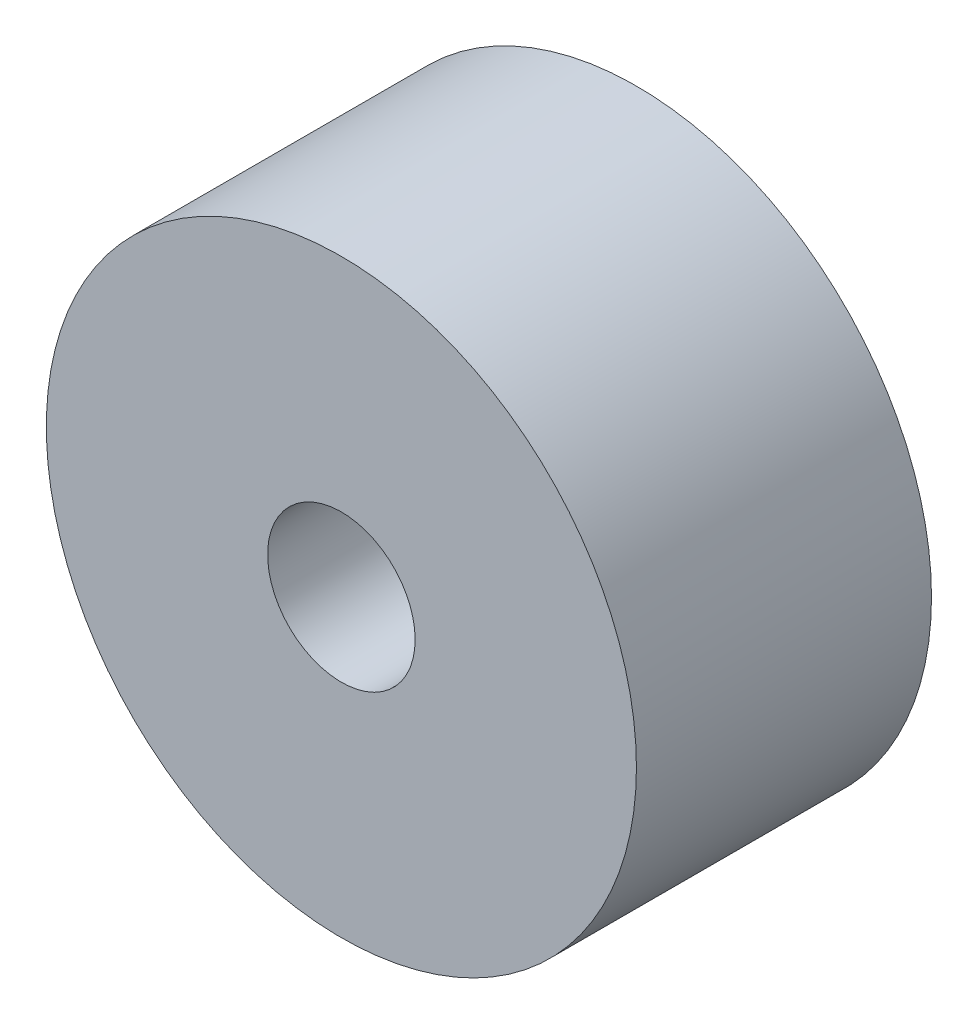
ISO-10303-21;
HEADER;
FILE_DESCRIPTION(('STEP AP214'),'2;1');
FILE_NAME('part.step','',(''),(''),'','','');
FILE_SCHEMA(('AUTOMOTIVE_DESIGN { 1 0 10303 214 1 1 1 1 }'));
ENDSEC;
DATA;
#1=APPLICATION_CONTEXT('core data for automotive mechanical design processes');
#2=APPLICATION_PROTOCOL_DEFINITION('international standard','automotive_design',2000,#1);
#3=PRODUCT_CONTEXT('',#1,'mechanical');
#4=PRODUCT('Part','Part','',(#3));
#5=PRODUCT_RELATED_PRODUCT_CATEGORY('part','',(#4));
#6=PRODUCT_DEFINITION_FORMATION('','',#4);
#7=PRODUCT_DEFINITION_CONTEXT('part definition',#1,'design');
#8=PRODUCT_DEFINITION('design','',#6,#7);
#9=PRODUCT_DEFINITION_SHAPE('','',#8);
#10=(LENGTH_UNIT() NAMED_UNIT(*) SI_UNIT(.MILLI.,.METRE.));
#11=(NAMED_UNIT(*) PLANE_ANGLE_UNIT() SI_UNIT($,.RADIAN.));
#12=(NAMED_UNIT(*) SI_UNIT($,.STERADIAN.) SOLID_ANGLE_UNIT());
#13=UNCERTAINTY_MEASURE_WITH_UNIT(LENGTH_MEASURE(1.E-05),#10,'distance_accuracy_value','');
#14=(GEOMETRIC_REPRESENTATION_CONTEXT(3) GLOBAL_UNCERTAINTY_ASSIGNED_CONTEXT((#13)) GLOBAL_UNIT_ASSIGNED_CONTEXT((#10,
#11,#12)) REPRESENTATION_CONTEXT('',''));
#15=CARTESIAN_POINT('',(0.,0.,0.));
#16=DIRECTION('',(0.,0.,1.));
#17=DIRECTION('',(1.,0.,0.));
#18=AXIS2_PLACEMENT_3D('',#15,#16,#17);
#19=CARTESIAN_POINT('',(0.,0.,6.));
#20=DIRECTION('',(0.,0.,1.));
#21=DIRECTION('',(1.,0.,0.));
#22=AXIS2_PLACEMENT_3D('',#19,#20,#21);
#23=PLANE('',#22);
#24=CARTESIAN_POINT('',(0.,0.,6.));
#25=DIRECTION('',(0.,0.,1.));
#26=DIRECTION('',(1.,0.,0.));
#27=AXIS2_PLACEMENT_3D('',#24,#25,#26);
#28=CIRCLE('',#27,6.);
#29=CARTESIAN_POINT('',(6.,0.,6.));
#30=VERTEX_POINT('',#29);
#31=EDGE_CURVE('E10',#30,#30,#28,.T.);
#32=ORIENTED_EDGE('',*,*,#31,.T.);
#33=EDGE_LOOP('',(#32));
#34=FACE_BOUND('',#33,.T.);
#35=CARTESIAN_POINT('',(0.,0.,6.));
#36=DIRECTION('',(0.,0.,1.));
#37=DIRECTION('',(1.,0.,0.));
#38=AXIS2_PLACEMENT_3D('',#35,#36,#37);
#39=CIRCLE('',#38,1.5);
#40=CARTESIAN_POINT('',(1.5,0.,6.));
#41=VERTEX_POINT('',#40);
#42=EDGE_CURVE('E45',#41,#41,#39,.T.);
#43=ORIENTED_EDGE('',*,*,#42,.F.);
#44=EDGE_LOOP('',(#43));
#45=FACE_BOUND('',#44,.T.);
#46=ADVANCED_FACE('F34',(#34,#45),#23,.T.);
#47=CARTESIAN_POINT('',(0.,0.,0.));
#48=DIRECTION('',(0.,0.,1.));
#49=DIRECTION('',(1.,0.,0.));
#50=AXIS2_PLACEMENT_3D('',#47,#48,#49);
#51=PLANE('',#50);
#52=CARTESIAN_POINT('',(0.,0.,0.));
#53=DIRECTION('',(0.,0.,1.));
#54=DIRECTION('',(1.,0.,0.));
#55=AXIS2_PLACEMENT_3D('',#52,#53,#54);
#56=CIRCLE('',#55,6.);
#57=CARTESIAN_POINT('',(6.,0.,0.));
#58=VERTEX_POINT('',#57);
#59=EDGE_CURVE('E38',#58,#58,#56,.T.);
#60=ORIENTED_EDGE('',*,*,#59,.F.);
#61=EDGE_LOOP('',(#60));
#62=FACE_BOUND('',#61,.T.);
#63=CARTESIAN_POINT('',(0.,0.,0.));
#64=DIRECTION('',(0.,0.,1.));
#65=DIRECTION('',(1.,0.,0.));
#66=AXIS2_PLACEMENT_3D('',#63,#64,#65);
#67=CIRCLE('',#66,1.5);
#68=CARTESIAN_POINT('',(1.5,0.,0.));
#69=VERTEX_POINT('',#68);
#70=EDGE_CURVE('E47',#69,#69,#67,.T.);
#71=ORIENTED_EDGE('',*,*,#70,.T.);
#72=EDGE_LOOP('',(#71));
#73=FACE_BOUND('',#72,.T.);
#74=ADVANCED_FACE('F57',(#62,#73),#51,.F.);
#75=CARTESIAN_POINT('',(0.,0.,6.));
#76=DIRECTION('',(0.,0.,-1.));
#77=DIRECTION('',(-1.,0.,0.));
#78=AXIS2_PLACEMENT_3D('',#75,#76,#77);
#79=CYLINDRICAL_SURFACE('',#78,6.);
#80=ORIENTED_EDGE('',*,*,#31,.F.);
#81=EDGE_LOOP('',(#80));
#82=FACE_BOUND('',#81,.T.);
#83=ORIENTED_EDGE('',*,*,#59,.T.);
#84=EDGE_LOOP('',(#83));
#85=FACE_BOUND('',#84,.T.);
#86=ADVANCED_FACE('F36',(#82,#85),#79,.T.);
#87=CARTESIAN_POINT('',(0.,0.,6.));
#88=DIRECTION('',(0.,0.,-1.));
#89=DIRECTION('',(-1.,0.,0.));
#90=AXIS2_PLACEMENT_3D('',#87,#88,#89);
#91=CYLINDRICAL_SURFACE('',#90,1.5);
#92=ORIENTED_EDGE('',*,*,#42,.T.);
#93=EDGE_LOOP('',(#92));
#94=FACE_BOUND('',#93,.T.);
#95=ORIENTED_EDGE('',*,*,#70,.F.);
#96=EDGE_LOOP('',(#95));
#97=FACE_BOUND('',#96,.T.);
#98=ADVANCED_FACE('F53',(#94,#97),#91,.F.);
#99=CLOSED_SHELL('',(#46,#74,#86,#98));
#100=MANIFOLD_SOLID_BREP('B2',#99);
#101=ADVANCED_BREP_SHAPE_REPRESENTATION('',(#18,#100),#14);
#102=SHAPE_DEFINITION_REPRESENTATION(#9,#101);
ENDSEC;
END-ISO-10303-21;
